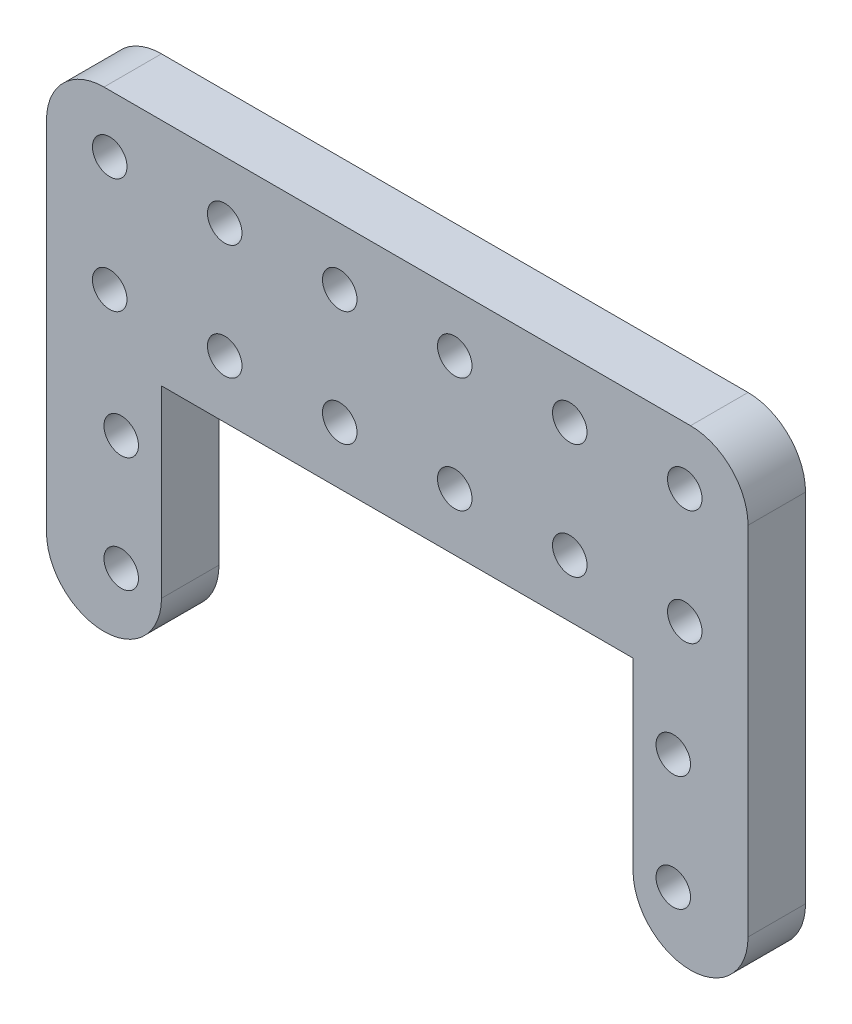
ISO-10303-21;
HEADER;
FILE_DESCRIPTION(('STEP AP214'),'2;1');
FILE_NAME('part.step','',(''),(''),'','','');
FILE_SCHEMA(('AUTOMOTIVE_DESIGN { 1 0 10303 214 1 1 1 1 }'));
ENDSEC;
DATA;
#1=APPLICATION_CONTEXT('core data for automotive mechanical design processes');
#2=APPLICATION_PROTOCOL_DEFINITION('international standard','automotive_design',2000,#1);
#3=PRODUCT_CONTEXT('',#1,'mechanical');
#4=PRODUCT('Part','Part','',(#3));
#5=PRODUCT_RELATED_PRODUCT_CATEGORY('part','',(#4));
#6=PRODUCT_DEFINITION_FORMATION('','',#4);
#7=PRODUCT_DEFINITION_CONTEXT('part definition',#1,'design');
#8=PRODUCT_DEFINITION('design','',#6,#7);
#9=PRODUCT_DEFINITION_SHAPE('','',#8);
#10=(LENGTH_UNIT() NAMED_UNIT(*) SI_UNIT(.MILLI.,.METRE.));
#11=(NAMED_UNIT(*) PLANE_ANGLE_UNIT() SI_UNIT($,.RADIAN.));
#12=(NAMED_UNIT(*) SI_UNIT($,.STERADIAN.) SOLID_ANGLE_UNIT());
#13=UNCERTAINTY_MEASURE_WITH_UNIT(LENGTH_MEASURE(1.E-05),#10,'distance_accuracy_value','');
#14=(GEOMETRIC_REPRESENTATION_CONTEXT(3) GLOBAL_UNCERTAINTY_ASSIGNED_CONTEXT((#13)) GLOBAL_UNIT_ASSIGNED_CONTEXT((#10,
#11,#12)) REPRESENTATION_CONTEXT('',''));
#15=CARTESIAN_POINT('',(0.,0.,0.));
#16=DIRECTION('',(0.,0.,1.));
#17=DIRECTION('',(1.,0.,0.));
#18=AXIS2_PLACEMENT_3D('',#15,#16,#17);
#19=CARTESIAN_POINT('',(54.2540510882395,0.,5.));
#20=DIRECTION('',(1.,0.,0.));
#21=DIRECTION('',(0.,1.,0.));
#22=AXIS2_PLACEMENT_3D('',#19,#20,#21);
#23=PLANE('',#22);
#24=DIRECTION('',(0.,-1.,0.));
#25=VECTOR('',#24,1.);
#26=CARTESIAN_POINT('',(54.2540510882395,0.,0.));
#27=LINE('',#26,#25);
#28=CARTESIAN_POINT('',(54.2540510882395,11.1987599390299,0.));
#29=VERTEX_POINT('',#28);
#30=CARTESIAN_POINT('',(54.2540510882395,-4.80124006097015,0.));
#31=VERTEX_POINT('',#30);
#32=EDGE_CURVE('E165',#29,#31,#27,.T.);
#33=ORIENTED_EDGE('',*,*,#32,.T.);
#34=DIRECTION('',(0.,0.,1.));
#35=VECTOR('',#34,1.);
#36=CARTESIAN_POINT('',(54.2540510882395,-4.80124006097015,5.));
#37=LINE('',#36,#35);
#38=CARTESIAN_POINT('',(54.2540510882395,-4.80124006097015,5.));
#39=VERTEX_POINT('',#38);
#40=EDGE_CURVE('E238',#31,#39,#37,.T.);
#41=ORIENTED_EDGE('',*,*,#40,.T.);
#42=DIRECTION('',(0.,-1.,0.));
#43=VECTOR('',#42,1.);
#44=CARTESIAN_POINT('',(54.2540510882395,0.,5.));
#45=LINE('',#44,#43);
#46=CARTESIAN_POINT('',(54.2540510882395,11.1987599390299,5.));
#47=VERTEX_POINT('',#46);
#48=EDGE_CURVE('E184',#47,#39,#45,.T.);
#49=ORIENTED_EDGE('',*,*,#48,.F.);
#50=DIRECTION('',(0.,0.,-1.));
#51=VECTOR('',#50,1.);
#52=CARTESIAN_POINT('',(54.2540510882395,11.1987599390299,5.));
#53=LINE('',#52,#51);
#54=EDGE_CURVE('E144',#47,#29,#53,.T.);
#55=ORIENTED_EDGE('',*,*,#54,.T.);
#56=EDGE_LOOP('',(#33,#41,#49,#55));
#57=FACE_BOUND('',#56,.T.);
#58=ADVANCED_FACE('F41',(#57),#23,.F.);
#59=CARTESIAN_POINT('',(64.2540510882395,0.,5.));
#60=DIRECTION('',(-1.,0.,0.));
#61=DIRECTION('',(0.,0.,1.));
#62=AXIS2_PLACEMENT_3D('',#59,#60,#61);
#63=PLANE('',#62);
#64=DIRECTION('',(0.,1.,0.));
#65=VECTOR('',#64,1.);
#66=CARTESIAN_POINT('',(64.2540510882395,0.,5.));
#67=LINE('',#66,#65);
#68=CARTESIAN_POINT('',(64.2540510882395,-4.80124006097015,5.));
#69=VERTEX_POINT('',#68);
#70=CARTESIAN_POINT('',(64.2540510882395,26.1987599390299,5.));
#71=VERTEX_POINT('',#70);
#72=EDGE_CURVE('E271',#69,#71,#67,.T.);
#73=ORIENTED_EDGE('',*,*,#72,.F.);
#74=DIRECTION('',(0.,0.,1.));
#75=VECTOR('',#74,1.);
#76=CARTESIAN_POINT('',(64.2540510882395,-4.80124006097015,5.));
#77=LINE('',#76,#75);
#78=CARTESIAN_POINT('',(64.2540510882395,-4.80124006097015,0.));
#79=VERTEX_POINT('',#78);
#80=EDGE_CURVE('E224',#69,#79,#77,.F.);
#81=ORIENTED_EDGE('',*,*,#80,.T.);
#82=DIRECTION('',(0.,1.,0.));
#83=VECTOR('',#82,1.);
#84=CARTESIAN_POINT('',(64.2540510882395,0.,0.));
#85=LINE('',#84,#83);
#86=CARTESIAN_POINT('',(64.2540510882395,26.1987599390299,0.));
#87=VERTEX_POINT('',#86);
#88=EDGE_CURVE('E169',#79,#87,#85,.T.);
#89=ORIENTED_EDGE('',*,*,#88,.T.);
#90=DIRECTION('',(0.,0.,-1.));
#91=VECTOR('',#90,1.);
#92=CARTESIAN_POINT('',(64.2540510882395,26.1987599390299,5.));
#93=LINE('',#92,#91);
#94=EDGE_CURVE('E143',#87,#71,#93,.F.);
#95=ORIENTED_EDGE('',*,*,#94,.T.);
#96=EDGE_LOOP('',(#73,#81,#89,#95));
#97=FACE_BOUND('',#96,.T.);
#98=ADVANCED_FACE('F446',(#97),#63,.F.);
#99=CARTESIAN_POINT('',(0.,31.1987599390299,5.));
#100=DIRECTION('',(0.,-1.,0.));
#101=DIRECTION('',(0.,0.,-1.));
#102=AXIS2_PLACEMENT_3D('',#99,#100,#101);
#103=PLANE('',#102);
#104=DIRECTION('',(-1.,0.,0.));
#105=VECTOR('',#104,1.);
#106=CARTESIAN_POINT('',(0.,31.1987599390299,0.));
#107=LINE('',#106,#105);
#108=CARTESIAN_POINT('',(59.2540510882395,31.1987599390299,0.));
#109=VERTEX_POINT('',#108);
#110=CARTESIAN_POINT('',(8.25405108823951,31.1987599390299,0.));
#111=VERTEX_POINT('',#110);
#112=EDGE_CURVE('E173',#109,#111,#107,.T.);
#113=ORIENTED_EDGE('',*,*,#112,.T.);
#114=DIRECTION('',(0.,0.,-1.));
#115=VECTOR('',#114,1.);
#116=CARTESIAN_POINT('',(8.25405108823951,31.1987599390299,5.));
#117=LINE('',#116,#115);
#118=CARTESIAN_POINT('',(8.25405108823951,31.1987599390299,5.));
#119=VERTEX_POINT('',#118);
#120=EDGE_CURVE('E210',#111,#119,#117,.F.);
#121=ORIENTED_EDGE('',*,*,#120,.T.);
#122=DIRECTION('',(-1.,0.,0.));
#123=VECTOR('',#122,1.);
#124=CARTESIAN_POINT('',(0.,31.1987599390299,5.));
#125=LINE('',#124,#123);
#126=CARTESIAN_POINT('',(59.2540510882395,31.1987599390299,5.));
#127=VERTEX_POINT('',#126);
#128=EDGE_CURVE('E269',#127,#119,#125,.T.);
#129=ORIENTED_EDGE('',*,*,#128,.F.);
#130=DIRECTION('',(0.,0.,-1.));
#131=VECTOR('',#130,1.);
#132=CARTESIAN_POINT('',(59.2540510882395,31.1987599390299,5.));
#133=LINE('',#132,#131);
#134=EDGE_CURVE('E206',#127,#109,#133,.T.);
#135=ORIENTED_EDGE('',*,*,#134,.T.);
#136=EDGE_LOOP('',(#113,#121,#129,#135));
#137=FACE_BOUND('',#136,.T.);
#138=ADVANCED_FACE('F452',(#137),#103,.F.);
#139=CARTESIAN_POINT('',(3.25405108823951,0.,5.));
#140=DIRECTION('',(1.,0.,0.));
#141=DIRECTION('',(0.,1.,0.));
#142=AXIS2_PLACEMENT_3D('',#139,#140,#141);
#143=PLANE('',#142);
#144=DIRECTION('',(0.,-1.,0.));
#145=VECTOR('',#144,1.);
#146=CARTESIAN_POINT('',(3.25405108823951,0.,0.));
#147=LINE('',#146,#145);
#148=CARTESIAN_POINT('',(3.25405108823951,26.1987599390299,0.));
#149=VERTEX_POINT('',#148);
#150=CARTESIAN_POINT('',(3.25405108823951,-4.80124006097015,0.));
#151=VERTEX_POINT('',#150);
#152=EDGE_CURVE('E177',#149,#151,#147,.T.);
#153=ORIENTED_EDGE('',*,*,#152,.T.);
#154=DIRECTION('',(0.,0.,1.));
#155=VECTOR('',#154,1.);
#156=CARTESIAN_POINT('',(3.25405108823951,-4.80124006097015,5.));
#157=LINE('',#156,#155);
#158=CARTESIAN_POINT('',(3.25405108823951,-4.80124006097015,5.));
#159=VERTEX_POINT('',#158);
#160=EDGE_CURVE('E11',#151,#159,#157,.T.);
#161=ORIENTED_EDGE('',*,*,#160,.T.);
#162=DIRECTION('',(0.,-1.,0.));
#163=VECTOR('',#162,1.);
#164=CARTESIAN_POINT('',(3.25405108823951,0.,5.));
#165=LINE('',#164,#163);
#166=CARTESIAN_POINT('',(3.25405108823951,26.1987599390299,5.));
#167=VERTEX_POINT('',#166);
#168=EDGE_CURVE('E155',#167,#159,#165,.T.);
#169=ORIENTED_EDGE('',*,*,#168,.F.);
#170=DIRECTION('',(0.,0.,-1.));
#171=VECTOR('',#170,1.);
#172=CARTESIAN_POINT('',(3.25405108823951,26.1987599390299,5.));
#173=LINE('',#172,#171);
#174=EDGE_CURVE('E202',#167,#149,#173,.T.);
#175=ORIENTED_EDGE('',*,*,#174,.T.);
#176=EDGE_LOOP('',(#153,#161,#169,#175));
#177=FACE_BOUND('',#176,.T.);
#178=ADVANCED_FACE('F264',(#177),#143,.F.);
#179=CARTESIAN_POINT('',(13.2540510882395,0.,5.));
#180=DIRECTION('',(1.,0.,0.));
#181=DIRECTION('',(0.,1.,0.));
#182=AXIS2_PLACEMENT_3D('',#179,#180,#181);
#183=PLANE('',#182);
#184=DIRECTION('',(0.,-1.,0.));
#185=VECTOR('',#184,1.);
#186=CARTESIAN_POINT('',(13.2540510882395,0.,5.));
#187=LINE('',#186,#185);
#188=CARTESIAN_POINT('',(13.2540510882395,11.1987599390298,5.));
#189=VERTEX_POINT('',#188);
#190=CARTESIAN_POINT('',(13.2540510882395,-4.80124006097015,5.));
#191=VERTEX_POINT('',#190);
#192=EDGE_CURVE('E135',#189,#191,#187,.T.);
#193=ORIENTED_EDGE('',*,*,#192,.T.);
#194=DIRECTION('',(0.,0.,1.));
#195=VECTOR('',#194,1.);
#196=CARTESIAN_POINT('',(13.2540510882395,-4.80124006097015,0.));
#197=LINE('',#196,#195);
#198=CARTESIAN_POINT('',(13.2540510882395,-4.80124006097015,0.));
#199=VERTEX_POINT('',#198);
#200=EDGE_CURVE('E51',#191,#199,#197,.F.);
#201=ORIENTED_EDGE('',*,*,#200,.T.);
#202=DIRECTION('',(0.,-1.,0.));
#203=VECTOR('',#202,1.);
#204=CARTESIAN_POINT('',(13.2540510882395,0.,0.));
#205=LINE('',#204,#203);
#206=CARTESIAN_POINT('',(13.2540510882395,11.1987599390298,0.));
#207=VERTEX_POINT('',#206);
#208=EDGE_CURVE('E137',#207,#199,#205,.T.);
#209=ORIENTED_EDGE('',*,*,#208,.F.);
#210=DIRECTION('',(0.,0.,-1.));
#211=VECTOR('',#210,1.);
#212=CARTESIAN_POINT('',(13.2540510882395,11.1987599390298,5.));
#213=LINE('',#212,#211);
#214=EDGE_CURVE('E131',#189,#207,#213,.T.);
#215=ORIENTED_EDGE('',*,*,#214,.F.);
#216=EDGE_LOOP('',(#193,#201,#209,#215));
#217=FACE_BOUND('',#216,.T.);
#218=ADVANCED_FACE('F133',(#217),#183,.T.);
#219=CARTESIAN_POINT('',(0.,11.1987599390298,5.));
#220=DIRECTION('',(0.,-1.,0.));
#221=DIRECTION('',(1.,0.,0.));
#222=AXIS2_PLACEMENT_3D('',#219,#220,#221);
#223=PLANE('',#222);
#224=DIRECTION('',(-1.,0.,0.));
#225=VECTOR('',#224,1.);
#226=CARTESIAN_POINT('',(0.,11.1987599390298,0.));
#227=LINE('',#226,#225);
#228=EDGE_CURVE('E182',#29,#207,#227,.T.);
#229=ORIENTED_EDGE('',*,*,#228,.F.);
#230=ORIENTED_EDGE('',*,*,#54,.F.);
#231=DIRECTION('',(-1.,0.,0.));
#232=VECTOR('',#231,1.);
#233=CARTESIAN_POINT('',(0.,11.1987599390298,5.));
#234=LINE('',#233,#232);
#235=EDGE_CURVE('E151',#47,#189,#234,.T.);
#236=ORIENTED_EDGE('',*,*,#235,.T.);
#237=ORIENTED_EDGE('',*,*,#214,.T.);
#238=EDGE_LOOP('',(#229,#230,#236,#237));
#239=FACE_BOUND('',#238,.T.);
#240=ADVANCED_FACE('F157',(#239),#223,.T.);
#241=CARTESIAN_POINT('',(0.,0.,5.));
#242=DIRECTION('',(0.,0.,1.));
#243=DIRECTION('',(1.,0.,0.));
#244=AXIS2_PLACEMENT_3D('',#241,#242,#243);
#245=PLANE('',#244);
#246=CARTESIAN_POINT('',(59.2540510882395,-4.80124006097015,5.));
#247=DIRECTION('',(0.,0.,1.));
#248=DIRECTION('',(1.,0.,0.));
#249=AXIS2_PLACEMENT_3D('',#246,#247,#248);
#250=CIRCLE('',#249,5.);
#251=CARTESIAN_POINT('',(59.2540510882395,-9.80124006097015,5.));
#252=VERTEX_POINT('',#251);
#253=EDGE_CURVE('E218',#39,#252,#250,.T.);
#254=ORIENTED_EDGE('',*,*,#253,.T.);
#255=CARTESIAN_POINT('',(59.2540510882395,-4.80124006097015,5.));
#256=DIRECTION('',(0.,0.,1.));
#257=DIRECTION('',(1.,0.,0.));
#258=AXIS2_PLACEMENT_3D('',#255,#256,#257);
#259=CIRCLE('',#258,5.);
#260=EDGE_CURVE('E221',#252,#69,#259,.T.);
#261=ORIENTED_EDGE('',*,*,#260,.T.);
#262=ORIENTED_EDGE('',*,*,#72,.T.);
#263=CARTESIAN_POINT('',(59.2540510882395,26.1987599390299,5.));
#264=DIRECTION('',(0.,0.,1.));
#265=DIRECTION('',(1.,0.,0.));
#266=AXIS2_PLACEMENT_3D('',#263,#264,#265);
#267=CIRCLE('',#266,5.);
#268=EDGE_CURVE('E196',#71,#127,#267,.T.);
#269=ORIENTED_EDGE('',*,*,#268,.T.);
#270=ORIENTED_EDGE('',*,*,#128,.T.);
#271=CARTESIAN_POINT('',(8.25405108823951,26.1987599390299,5.));
#272=DIRECTION('',(0.,0.,1.));
#273=DIRECTION('',(1.,0.,0.));
#274=AXIS2_PLACEMENT_3D('',#271,#272,#273);
#275=CIRCLE('',#274,5.);
#276=EDGE_CURVE('E199',#119,#167,#275,.T.);
#277=ORIENTED_EDGE('',*,*,#276,.T.);
#278=ORIENTED_EDGE('',*,*,#168,.T.);
#279=CARTESIAN_POINT('',(8.25405108823951,-4.80124006097015,5.));
#280=DIRECTION('',(0.,0.,1.));
#281=DIRECTION('',(1.,0.,0.));
#282=AXIS2_PLACEMENT_3D('',#279,#280,#281);
#283=CIRCLE('',#282,5.);
#284=CARTESIAN_POINT('',(8.25405108823951,-9.80124006097015,5.));
#285=VERTEX_POINT('',#284);
#286=EDGE_CURVE('E213',#159,#285,#283,.T.);
#287=ORIENTED_EDGE('',*,*,#286,.T.);
#288=CARTESIAN_POINT('',(8.25405108823951,-4.80124006097015,5.));
#289=DIRECTION('',(0.,0.,1.));
#290=DIRECTION('',(1.,0.,0.));
#291=AXIS2_PLACEMENT_3D('',#288,#289,#290);
#292=CIRCLE('',#291,5.);
#293=EDGE_CURVE('E153',#285,#191,#292,.T.);
#294=ORIENTED_EDGE('',*,*,#293,.T.);
#295=ORIENTED_EDGE('',*,*,#192,.F.);
#296=ORIENTED_EDGE('',*,*,#235,.F.);
#297=ORIENTED_EDGE('',*,*,#48,.T.);
#298=EDGE_LOOP('',(#254,#261,#262,#269,#270,#277,#278,#287,#294,#295,#296,#297));
#299=FACE_BOUND('',#298,.T.);
#300=CARTESIAN_POINT('',(58.7540510882395,26.1987599390299,5.));
#301=DIRECTION('',(0.,0.,1.));
#302=DIRECTION('',(1.,0.,0.));
#303=AXIS2_PLACEMENT_3D('',#300,#301,#302);
#304=CIRCLE('',#303,1.5);
#305=CARTESIAN_POINT('',(60.2540510882395,26.1987599390299,5.));
#306=VERTEX_POINT('',#305);
#307=EDGE_CURVE('E359',#306,#306,#304,.T.);
#308=ORIENTED_EDGE('',*,*,#307,.F.);
#309=EDGE_LOOP('',(#308));
#310=FACE_BOUND('',#309,.T.);
#311=CARTESIAN_POINT('',(18.7540510882396,16.1987599390299,5.));
#312=DIRECTION('',(0.,0.,1.));
#313=DIRECTION('',(1.,0.,0.));
#314=AXIS2_PLACEMENT_3D('',#311,#312,#313);
#315=CIRCLE('',#314,1.5);
#316=CARTESIAN_POINT('',(20.2540510882396,16.1987599390299,5.));
#317=VERTEX_POINT('',#316);
#318=EDGE_CURVE('E350',#317,#317,#315,.T.);
#319=ORIENTED_EDGE('',*,*,#318,.F.);
#320=EDGE_LOOP('',(#319));
#321=FACE_BOUND('',#320,.T.);
#322=CARTESIAN_POINT('',(28.7540510882396,16.1987599390299,5.));
#323=DIRECTION('',(0.,0.,1.));
#324=DIRECTION('',(1.,0.,0.));
#325=AXIS2_PLACEMENT_3D('',#322,#323,#324);
#326=CIRCLE('',#325,1.5);
#327=CARTESIAN_POINT('',(30.2540510882396,16.1987599390299,5.));
#328=VERTEX_POINT('',#327);
#329=EDGE_CURVE('E375',#328,#328,#326,.T.);
#330=ORIENTED_EDGE('',*,*,#329,.F.);
#331=EDGE_LOOP('',(#330));
#332=FACE_BOUND('',#331,.T.);
#333=CARTESIAN_POINT('',(38.7540510882396,16.1987599390299,5.));
#334=DIRECTION('',(0.,0.,1.));
#335=DIRECTION('',(1.,0.,0.));
#336=AXIS2_PLACEMENT_3D('',#333,#334,#335);
#337=CIRCLE('',#336,1.5);
#338=CARTESIAN_POINT('',(40.2540510882396,16.1987599390299,5.));
#339=VERTEX_POINT('',#338);
#340=EDGE_CURVE('E366',#339,#339,#337,.T.);
#341=ORIENTED_EDGE('',*,*,#340,.F.);
#342=EDGE_LOOP('',(#341));
#343=FACE_BOUND('',#342,.T.);
#344=CARTESIAN_POINT('',(48.7540510882395,26.1987599390299,5.));
#345=DIRECTION('',(0.,0.,1.));
#346=DIRECTION('',(1.,0.,0.));
#347=AXIS2_PLACEMENT_3D('',#344,#345,#346);
#348=CIRCLE('',#347,1.5);
#349=CARTESIAN_POINT('',(50.2540510882395,26.1987599390299,5.));
#350=VERTEX_POINT('',#349);
#351=EDGE_CURVE('E318',#350,#350,#348,.T.);
#352=ORIENTED_EDGE('',*,*,#351,.F.);
#353=EDGE_LOOP('',(#352));
#354=FACE_BOUND('',#353,.T.);
#355=CARTESIAN_POINT('',(38.7540510882395,26.1987599390299,5.));
#356=DIRECTION('',(0.,0.,1.));
#357=DIRECTION('',(1.,0.,0.));
#358=AXIS2_PLACEMENT_3D('',#355,#356,#357);
#359=CIRCLE('',#358,1.5);
#360=CARTESIAN_POINT('',(40.2540510882395,26.1987599390299,5.));
#361=VERTEX_POINT('',#360);
#362=EDGE_CURVE('E327',#361,#361,#359,.T.);
#363=ORIENTED_EDGE('',*,*,#362,.F.);
#364=EDGE_LOOP('',(#363));
#365=FACE_BOUND('',#364,.T.);
#366=CARTESIAN_POINT('',(28.7540510882395,26.1987599390299,5.));
#367=DIRECTION('',(0.,0.,1.));
#368=DIRECTION('',(1.,0.,0.));
#369=AXIS2_PLACEMENT_3D('',#366,#367,#368);
#370=CIRCLE('',#369,1.5);
#371=CARTESIAN_POINT('',(30.2540510882395,26.1987599390299,5.));
#372=VERTEX_POINT('',#371);
#373=EDGE_CURVE('E335',#372,#372,#370,.T.);
#374=ORIENTED_EDGE('',*,*,#373,.F.);
#375=EDGE_LOOP('',(#374));
#376=FACE_BOUND('',#375,.T.);
#377=CARTESIAN_POINT('',(18.7540510882395,26.1987599390299,5.));
#378=DIRECTION('',(0.,0.,1.));
#379=DIRECTION('',(1.,0.,0.));
#380=AXIS2_PLACEMENT_3D('',#377,#378,#379);
#381=CIRCLE('',#380,1.5);
#382=CARTESIAN_POINT('',(20.2540510882395,26.1987599390299,5.));
#383=VERTEX_POINT('',#382);
#384=EDGE_CURVE('E343',#383,#383,#381,.T.);
#385=ORIENTED_EDGE('',*,*,#384,.F.);
#386=EDGE_LOOP('',(#385));
#387=FACE_BOUND('',#386,.T.);
#388=CARTESIAN_POINT('',(48.7540510882396,16.1987599390299,5.));
#389=DIRECTION('',(0.,0.,1.));
#390=DIRECTION('',(1.,0.,0.));
#391=AXIS2_PLACEMENT_3D('',#388,#389,#390);
#392=CIRCLE('',#391,1.5);
#393=CARTESIAN_POINT('',(50.2540510882396,16.1987599390299,5.));
#394=VERTEX_POINT('',#393);
#395=EDGE_CURVE('E393',#394,#394,#392,.T.);
#396=ORIENTED_EDGE('',*,*,#395,.F.);
#397=EDGE_LOOP('',(#396));
#398=FACE_BOUND('',#397,.T.);
#399=CARTESIAN_POINT('',(58.7540510882396,16.1987599390299,5.));
#400=DIRECTION('',(0.,0.,1.));
#401=DIRECTION('',(1.,0.,0.));
#402=AXIS2_PLACEMENT_3D('',#399,#400,#401);
#403=CIRCLE('',#402,1.5);
#404=CARTESIAN_POINT('',(60.2540510882396,16.1987599390299,5.));
#405=VERTEX_POINT('',#404);
#406=EDGE_CURVE('E385',#405,#405,#403,.T.);
#407=ORIENTED_EDGE('',*,*,#406,.F.);
#408=EDGE_LOOP('',(#407));
#409=FACE_BOUND('',#408,.T.);
#410=CARTESIAN_POINT('',(8.75405108823961,16.1987599390299,5.));
#411=DIRECTION('',(0.,0.,1.));
#412=DIRECTION('',(1.,0.,0.));
#413=AXIS2_PLACEMENT_3D('',#410,#411,#412);
#414=CIRCLE('',#413,1.5);
#415=CARTESIAN_POINT('',(10.2540510882396,16.1987599390299,5.));
#416=VERTEX_POINT('',#415);
#417=EDGE_CURVE('E245',#416,#416,#414,.T.);
#418=ORIENTED_EDGE('',*,*,#417,.F.);
#419=EDGE_LOOP('',(#418));
#420=FACE_BOUND('',#419,.T.);
#421=CARTESIAN_POINT('',(8.75405108823951,26.1987599390299,5.));
#422=DIRECTION('',(0.,0.,1.));
#423=DIRECTION('',(1.,0.,0.));
#424=AXIS2_PLACEMENT_3D('',#421,#422,#423);
#425=CIRCLE('',#424,1.5);
#426=CARTESIAN_POINT('',(10.2540510882395,26.1987599390299,5.));
#427=VERTEX_POINT('',#426);
#428=EDGE_CURVE('E310',#427,#427,#425,.T.);
#429=ORIENTED_EDGE('',*,*,#428,.F.);
#430=EDGE_LOOP('',(#429));
#431=FACE_BOUND('',#430,.T.);
#432=CARTESIAN_POINT('',(57.7540510882395,-4.30124006097015,5.));
#433=DIRECTION('',(0.,0.,1.));
#434=DIRECTION('',(1.,0.,0.));
#435=AXIS2_PLACEMENT_3D('',#432,#433,#434);
#436=CIRCLE('',#435,1.5);
#437=CARTESIAN_POINT('',(59.2540510882395,-4.30124006097015,5.));
#438=VERTEX_POINT('',#437);
#439=EDGE_CURVE('E286',#438,#438,#436,.T.);
#440=ORIENTED_EDGE('',*,*,#439,.F.);
#441=EDGE_LOOP('',(#440));
#442=FACE_BOUND('',#441,.T.);
#443=CARTESIAN_POINT('',(57.7540510882395,5.69875993902985,5.));
#444=DIRECTION('',(0.,0.,1.));
#445=DIRECTION('',(1.,0.,0.));
#446=AXIS2_PLACEMENT_3D('',#443,#444,#445);
#447=CIRCLE('',#446,1.5);
#448=CARTESIAN_POINT('',(59.2540510882395,5.69875993902985,5.));
#449=VERTEX_POINT('',#448);
#450=EDGE_CURVE('E295',#449,#449,#447,.T.);
#451=ORIENTED_EDGE('',*,*,#450,.F.);
#452=EDGE_LOOP('',(#451));
#453=FACE_BOUND('',#452,.T.);
#454=CARTESIAN_POINT('',(9.7540510882395,5.69875993902985,5.));
#455=DIRECTION('',(0.,0.,1.));
#456=DIRECTION('',(1.,0.,0.));
#457=AXIS2_PLACEMENT_3D('',#454,#455,#456);
#458=CIRCLE('',#457,1.5);
#459=CARTESIAN_POINT('',(11.2540510882395,5.69875993902985,5.));
#460=VERTEX_POINT('',#459);
#461=EDGE_CURVE('E303',#460,#460,#458,.T.);
#462=ORIENTED_EDGE('',*,*,#461,.F.);
#463=EDGE_LOOP('',(#462));
#464=FACE_BOUND('',#463,.T.);
#465=CARTESIAN_POINT('',(9.75405108823951,-4.30124006097015,5.));
#466=DIRECTION('',(0.,0.,1.));
#467=DIRECTION('',(1.,0.,0.));
#468=AXIS2_PLACEMENT_3D('',#465,#466,#467);
#469=CIRCLE('',#468,1.5);
#470=CARTESIAN_POINT('',(11.2540510882395,-4.30124006097015,5.));
#471=VERTEX_POINT('',#470);
#472=EDGE_CURVE('E278',#471,#471,#469,.T.);
#473=ORIENTED_EDGE('',*,*,#472,.F.);
#474=EDGE_LOOP('',(#473));
#475=FACE_BOUND('',#474,.T.);
#476=ADVANCED_FACE('F148',(#299,#310,#321,#332,#343,#354,#365,#376,#387,#398,#409,#420,#431,
#442,#453,#464,#475),#245,.T.);
#477=CARTESIAN_POINT('',(0.,0.,0.));
#478=DIRECTION('',(0.,0.,1.));
#479=DIRECTION('',(1.,0.,0.));
#480=AXIS2_PLACEMENT_3D('',#477,#478,#479);
#481=PLANE('',#480);
#482=CARTESIAN_POINT('',(58.7540510882395,26.1987599390299,0.));
#483=DIRECTION('',(0.,0.,1.));
#484=DIRECTION('',(1.,0.,0.));
#485=AXIS2_PLACEMENT_3D('',#482,#483,#484);
#486=CIRCLE('',#485,1.5);
#487=CARTESIAN_POINT('',(60.2540510882395,26.1987599390299,0.));
#488=VERTEX_POINT('',#487);
#489=EDGE_CURVE('E323',#488,#488,#486,.T.);
#490=ORIENTED_EDGE('',*,*,#489,.T.);
#491=EDGE_LOOP('',(#490));
#492=FACE_BOUND('',#491,.T.);
#493=CARTESIAN_POINT('',(18.7540510882396,16.1987599390299,0.));
#494=DIRECTION('',(0.,0.,1.));
#495=DIRECTION('',(1.,0.,0.));
#496=AXIS2_PLACEMENT_3D('',#493,#494,#495);
#497=CIRCLE('',#496,1.5);
#498=CARTESIAN_POINT('',(20.2540510882396,16.1987599390299,0.));
#499=VERTEX_POINT('',#498);
#500=EDGE_CURVE('E354',#499,#499,#497,.T.);
#501=ORIENTED_EDGE('',*,*,#500,.T.);
#502=EDGE_LOOP('',(#501));
#503=FACE_BOUND('',#502,.T.);
#504=CARTESIAN_POINT('',(28.7540510882396,16.1987599390299,0.));
#505=DIRECTION('',(0.,0.,1.));
#506=DIRECTION('',(1.,0.,0.));
#507=AXIS2_PLACEMENT_3D('',#504,#505,#506);
#508=CIRCLE('',#507,1.5);
#509=CARTESIAN_POINT('',(30.2540510882396,16.1987599390299,0.));
#510=VERTEX_POINT('',#509);
#511=EDGE_CURVE('E355',#510,#510,#508,.T.);
#512=ORIENTED_EDGE('',*,*,#511,.T.);
#513=EDGE_LOOP('',(#512));
#514=FACE_BOUND('',#513,.T.);
#515=CARTESIAN_POINT('',(38.7540510882396,16.1987599390299,0.));
#516=DIRECTION('',(0.,0.,1.));
#517=DIRECTION('',(1.,0.,0.));
#518=AXIS2_PLACEMENT_3D('',#515,#516,#517);
#519=CIRCLE('',#518,1.5);
#520=CARTESIAN_POINT('',(40.2540510882396,16.1987599390299,0.));
#521=VERTEX_POINT('',#520);
#522=EDGE_CURVE('E370',#521,#521,#519,.T.);
#523=ORIENTED_EDGE('',*,*,#522,.T.);
#524=EDGE_LOOP('',(#523));
#525=FACE_BOUND('',#524,.T.);
#526=CARTESIAN_POINT('',(48.7540510882395,26.1987599390299,0.));
#527=DIRECTION('',(0.,0.,1.));
#528=DIRECTION('',(1.,0.,0.));
#529=AXIS2_PLACEMENT_3D('',#526,#527,#528);
#530=CIRCLE('',#529,1.5);
#531=CARTESIAN_POINT('',(50.2540510882395,26.1987599390299,0.));
#532=VERTEX_POINT('',#531);
#533=EDGE_CURVE('E322',#532,#532,#530,.T.);
#534=ORIENTED_EDGE('',*,*,#533,.T.);
#535=EDGE_LOOP('',(#534));
#536=FACE_BOUND('',#535,.T.);
#537=CARTESIAN_POINT('',(38.7540510882395,26.1987599390299,0.));
#538=DIRECTION('',(0.,0.,1.));
#539=DIRECTION('',(1.,0.,0.));
#540=AXIS2_PLACEMENT_3D('',#537,#538,#539);
#541=CIRCLE('',#540,1.5);
#542=CARTESIAN_POINT('',(40.2540510882395,26.1987599390299,0.));
#543=VERTEX_POINT('',#542);
#544=EDGE_CURVE('E331',#543,#543,#541,.T.);
#545=ORIENTED_EDGE('',*,*,#544,.T.);
#546=EDGE_LOOP('',(#545));
#547=FACE_BOUND('',#546,.T.);
#548=CARTESIAN_POINT('',(28.7540510882395,26.1987599390299,0.));
#549=DIRECTION('',(0.,0.,1.));
#550=DIRECTION('',(1.,0.,0.));
#551=AXIS2_PLACEMENT_3D('',#548,#549,#550);
#552=CIRCLE('',#551,1.5);
#553=CARTESIAN_POINT('',(30.2540510882395,26.1987599390299,0.));
#554=VERTEX_POINT('',#553);
#555=EDGE_CURVE('E339',#554,#554,#552,.T.);
#556=ORIENTED_EDGE('',*,*,#555,.T.);
#557=EDGE_LOOP('',(#556));
#558=FACE_BOUND('',#557,.T.);
#559=CARTESIAN_POINT('',(18.7540510882395,26.1987599390299,0.));
#560=DIRECTION('',(0.,0.,1.));
#561=DIRECTION('',(1.,0.,0.));
#562=AXIS2_PLACEMENT_3D('',#559,#560,#561);
#563=CIRCLE('',#562,1.5);
#564=CARTESIAN_POINT('',(20.2540510882395,26.1987599390299,0.));
#565=VERTEX_POINT('',#564);
#566=EDGE_CURVE('E314',#565,#565,#563,.T.);
#567=ORIENTED_EDGE('',*,*,#566,.T.);
#568=EDGE_LOOP('',(#567));
#569=FACE_BOUND('',#568,.T.);
#570=CARTESIAN_POINT('',(48.7540510882396,16.1987599390299,0.));
#571=DIRECTION('',(0.,0.,1.));
#572=DIRECTION('',(1.,0.,0.));
#573=AXIS2_PLACEMENT_3D('',#570,#571,#572);
#574=CIRCLE('',#573,1.5);
#575=CARTESIAN_POINT('',(50.2540510882396,16.1987599390299,0.));
#576=VERTEX_POINT('',#575);
#577=EDGE_CURVE('E371',#576,#576,#574,.T.);
#578=ORIENTED_EDGE('',*,*,#577,.T.);
#579=EDGE_LOOP('',(#578));
#580=FACE_BOUND('',#579,.T.);
#581=CARTESIAN_POINT('',(58.7540510882396,16.1987599390299,0.));
#582=DIRECTION('',(0.,0.,1.));
#583=DIRECTION('',(1.,0.,0.));
#584=AXIS2_PLACEMENT_3D('',#581,#582,#583);
#585=CIRCLE('',#584,1.5);
#586=CARTESIAN_POINT('',(60.2540510882396,16.1987599390299,0.));
#587=VERTEX_POINT('',#586);
#588=EDGE_CURVE('E389',#587,#587,#585,.T.);
#589=ORIENTED_EDGE('',*,*,#588,.T.);
#590=EDGE_LOOP('',(#589));
#591=FACE_BOUND('',#590,.T.);
#592=CARTESIAN_POINT('',(8.75405108823961,16.1987599390299,0.));
#593=DIRECTION('',(0.,0.,1.));
#594=DIRECTION('',(1.,0.,0.));
#595=AXIS2_PLACEMENT_3D('',#592,#593,#594);
#596=CIRCLE('',#595,1.5);
#597=CARTESIAN_POINT('',(10.2540510882396,16.1987599390299,0.));
#598=VERTEX_POINT('',#597);
#599=EDGE_CURVE('E252',#598,#598,#596,.T.);
#600=ORIENTED_EDGE('',*,*,#599,.T.);
#601=EDGE_LOOP('',(#600));
#602=FACE_BOUND('',#601,.T.);
#603=CARTESIAN_POINT('',(8.75405108823951,26.1987599390299,0.));
#604=DIRECTION('',(0.,0.,1.));
#605=DIRECTION('',(1.,0.,0.));
#606=AXIS2_PLACEMENT_3D('',#603,#604,#605);
#607=CIRCLE('',#606,1.5);
#608=CARTESIAN_POINT('',(10.2540510882395,26.1987599390299,0.));
#609=VERTEX_POINT('',#608);
#610=EDGE_CURVE('E291',#609,#609,#607,.T.);
#611=ORIENTED_EDGE('',*,*,#610,.T.);
#612=EDGE_LOOP('',(#611));
#613=FACE_BOUND('',#612,.T.);
#614=CARTESIAN_POINT('',(57.7540510882395,-4.30124006097015,0.));
#615=DIRECTION('',(0.,0.,1.));
#616=DIRECTION('',(1.,0.,0.));
#617=AXIS2_PLACEMENT_3D('',#614,#615,#616);
#618=CIRCLE('',#617,1.5);
#619=CARTESIAN_POINT('',(59.2540510882395,-4.30124006097015,0.));
#620=VERTEX_POINT('',#619);
#621=EDGE_CURVE('E290',#620,#620,#618,.T.);
#622=ORIENTED_EDGE('',*,*,#621,.T.);
#623=EDGE_LOOP('',(#622));
#624=FACE_BOUND('',#623,.T.);
#625=CARTESIAN_POINT('',(57.7540510882395,5.69875993902985,0.));
#626=DIRECTION('',(0.,0.,1.));
#627=DIRECTION('',(1.,0.,0.));
#628=AXIS2_PLACEMENT_3D('',#625,#626,#627);
#629=CIRCLE('',#628,1.5);
#630=CARTESIAN_POINT('',(59.2540510882395,5.69875993902985,0.));
#631=VERTEX_POINT('',#630);
#632=EDGE_CURVE('E299',#631,#631,#629,.T.);
#633=ORIENTED_EDGE('',*,*,#632,.T.);
#634=EDGE_LOOP('',(#633));
#635=FACE_BOUND('',#634,.T.);
#636=CARTESIAN_POINT('',(9.7540510882395,5.69875993902985,0.));
#637=DIRECTION('',(0.,0.,1.));
#638=DIRECTION('',(1.,0.,0.));
#639=AXIS2_PLACEMENT_3D('',#636,#637,#638);
#640=CIRCLE('',#639,1.5);
#641=CARTESIAN_POINT('',(11.2540510882395,5.69875993902985,0.));
#642=VERTEX_POINT('',#641);
#643=EDGE_CURVE('E282',#642,#642,#640,.T.);
#644=ORIENTED_EDGE('',*,*,#643,.T.);
#645=EDGE_LOOP('',(#644));
#646=FACE_BOUND('',#645,.T.);
#647=CARTESIAN_POINT('',(9.75405108823951,-4.30124006097015,0.));
#648=DIRECTION('',(0.,0.,1.));
#649=DIRECTION('',(1.,0.,0.));
#650=AXIS2_PLACEMENT_3D('',#647,#648,#649);
#651=CIRCLE('',#650,1.5);
#652=CARTESIAN_POINT('',(11.2540510882395,-4.30124006097015,0.));
#653=VERTEX_POINT('',#652);
#654=EDGE_CURVE('E170',#653,#653,#651,.T.);
#655=ORIENTED_EDGE('',*,*,#654,.T.);
#656=EDGE_LOOP('',(#655));
#657=FACE_BOUND('',#656,.T.);
#658=ORIENTED_EDGE('',*,*,#88,.F.);
#659=CARTESIAN_POINT('',(59.2540510882395,-4.80124006097015,0.));
#660=DIRECTION('',(0.,0.,1.));
#661=DIRECTION('',(1.,0.,0.));
#662=AXIS2_PLACEMENT_3D('',#659,#660,#661);
#663=CIRCLE('',#662,5.);
#664=CARTESIAN_POINT('',(59.2540510882395,-9.80124006097015,0.));
#665=VERTEX_POINT('',#664);
#666=EDGE_CURVE('E235',#79,#665,#663,.F.);
#667=ORIENTED_EDGE('',*,*,#666,.T.);
#668=CARTESIAN_POINT('',(59.2540510882395,-4.80124006097015,0.));
#669=DIRECTION('',(0.,0.,1.));
#670=DIRECTION('',(1.,0.,0.));
#671=AXIS2_PLACEMENT_3D('',#668,#669,#670);
#672=CIRCLE('',#671,5.);
#673=EDGE_CURVE('E232',#665,#31,#672,.F.);
#674=ORIENTED_EDGE('',*,*,#673,.T.);
#675=ORIENTED_EDGE('',*,*,#32,.F.);
#676=ORIENTED_EDGE('',*,*,#228,.T.);
#677=ORIENTED_EDGE('',*,*,#208,.T.);
#678=CARTESIAN_POINT('',(8.25405108823951,-4.80124006097015,0.));
#679=DIRECTION('',(0.,0.,1.));
#680=DIRECTION('',(1.,0.,0.));
#681=AXIS2_PLACEMENT_3D('',#678,#679,#680);
#682=CIRCLE('',#681,5.);
#683=CARTESIAN_POINT('',(8.25405108823951,-9.80124006097015,0.));
#684=VERTEX_POINT('',#683);
#685=EDGE_CURVE('E64',#199,#684,#682,.F.);
#686=ORIENTED_EDGE('',*,*,#685,.T.);
#687=CARTESIAN_POINT('',(8.25405108823951,-4.80124006097015,0.));
#688=DIRECTION('',(0.,0.,1.));
#689=DIRECTION('',(1.,0.,0.));
#690=AXIS2_PLACEMENT_3D('',#687,#688,#689);
#691=CIRCLE('',#690,5.);
#692=EDGE_CURVE('E59',#684,#151,#691,.F.);
#693=ORIENTED_EDGE('',*,*,#692,.T.);
#694=ORIENTED_EDGE('',*,*,#152,.F.);
#695=CARTESIAN_POINT('',(8.25405108823951,26.1987599390299,0.));
#696=DIRECTION('',(0.,0.,1.));
#697=DIRECTION('',(1.,0.,0.));
#698=AXIS2_PLACEMENT_3D('',#695,#696,#697);
#699=CIRCLE('',#698,5.);
#700=EDGE_CURVE('E193',#149,#111,#699,.F.);
#701=ORIENTED_EDGE('',*,*,#700,.T.);
#702=ORIENTED_EDGE('',*,*,#112,.F.);
#703=CARTESIAN_POINT('',(59.2540510882395,26.1987599390299,0.));
#704=DIRECTION('',(0.,0.,1.));
#705=DIRECTION('',(1.,0.,0.));
#706=AXIS2_PLACEMENT_3D('',#703,#704,#705);
#707=CIRCLE('',#706,5.);
#708=EDGE_CURVE('E189',#109,#87,#707,.F.);
#709=ORIENTED_EDGE('',*,*,#708,.T.);
#710=EDGE_LOOP('',(#658,#667,#674,#675,#676,#677,#686,#693,#694,#701,#702,#709));
#711=FACE_BOUND('',#710,.T.);
#712=ADVANCED_FACE('F401',(#492,#503,#514,#525,#536,#547,#558,#569,#580,#591,#602,#613,#624,
#635,#646,#657,#711),#481,.F.);
#713=CARTESIAN_POINT('',(9.75405108823951,-4.30124006097015,0.));
#714=DIRECTION('',(0.,0.,1.));
#715=DIRECTION('',(1.,0.,0.));
#716=AXIS2_PLACEMENT_3D('',#713,#714,#715);
#717=CYLINDRICAL_SURFACE('',#716,1.5);
#718=ORIENTED_EDGE('',*,*,#654,.F.);
#719=EDGE_LOOP('',(#718));
#720=FACE_BOUND('',#719,.T.);
#721=ORIENTED_EDGE('',*,*,#472,.T.);
#722=EDGE_LOOP('',(#721));
#723=FACE_BOUND('',#722,.T.);
#724=ADVANCED_FACE('F429',(#720,#723),#717,.F.);
#725=CARTESIAN_POINT('',(9.7540510882395,5.69875993902985,0.));
#726=DIRECTION('',(0.,0.,1.));
#727=DIRECTION('',(1.,0.,0.));
#728=AXIS2_PLACEMENT_3D('',#725,#726,#727);
#729=CYLINDRICAL_SURFACE('',#728,1.5);
#730=ORIENTED_EDGE('',*,*,#643,.F.);
#731=EDGE_LOOP('',(#730));
#732=FACE_BOUND('',#731,.T.);
#733=ORIENTED_EDGE('',*,*,#461,.T.);
#734=EDGE_LOOP('',(#733));
#735=FACE_BOUND('',#734,.T.);
#736=ADVANCED_FACE('F431',(#732,#735),#729,.F.);
#737=CARTESIAN_POINT('',(57.7540510882395,5.69875993902985,0.));
#738=DIRECTION('',(0.,0.,1.));
#739=DIRECTION('',(1.,0.,0.));
#740=AXIS2_PLACEMENT_3D('',#737,#738,#739);
#741=CYLINDRICAL_SURFACE('',#740,1.5);
#742=ORIENTED_EDGE('',*,*,#632,.F.);
#743=EDGE_LOOP('',(#742));
#744=FACE_BOUND('',#743,.T.);
#745=ORIENTED_EDGE('',*,*,#450,.T.);
#746=EDGE_LOOP('',(#745));
#747=FACE_BOUND('',#746,.T.);
#748=ADVANCED_FACE('F438',(#744,#747),#741,.F.);
#749=CARTESIAN_POINT('',(57.7540510882395,-4.30124006097015,0.));
#750=DIRECTION('',(0.,0.,1.));
#751=DIRECTION('',(1.,0.,0.));
#752=AXIS2_PLACEMENT_3D('',#749,#750,#751);
#753=CYLINDRICAL_SURFACE('',#752,1.5);
#754=ORIENTED_EDGE('',*,*,#621,.F.);
#755=EDGE_LOOP('',(#754));
#756=FACE_BOUND('',#755,.T.);
#757=ORIENTED_EDGE('',*,*,#439,.T.);
#758=EDGE_LOOP('',(#757));
#759=FACE_BOUND('',#758,.T.);
#760=ADVANCED_FACE('F584',(#756,#759),#753,.F.);
#761=CARTESIAN_POINT('',(8.75405108823951,26.1987599390299,0.));
#762=DIRECTION('',(0.,0.,1.));
#763=DIRECTION('',(1.,0.,0.));
#764=AXIS2_PLACEMENT_3D('',#761,#762,#763);
#765=CYLINDRICAL_SURFACE('',#764,1.5);
#766=ORIENTED_EDGE('',*,*,#610,.F.);
#767=EDGE_LOOP('',(#766));
#768=FACE_BOUND('',#767,.T.);
#769=ORIENTED_EDGE('',*,*,#428,.T.);
#770=EDGE_LOOP('',(#769));
#771=FACE_BOUND('',#770,.T.);
#772=ADVANCED_FACE('F576',(#768,#771),#765,.F.);
#773=CARTESIAN_POINT('',(8.75405108823961,16.1987599390299,0.));
#774=DIRECTION('',(0.,0.,1.));
#775=DIRECTION('',(1.,0.,0.));
#776=AXIS2_PLACEMENT_3D('',#773,#774,#775);
#777=CYLINDRICAL_SURFACE('',#776,1.5);
#778=ORIENTED_EDGE('',*,*,#599,.F.);
#779=EDGE_LOOP('',(#778));
#780=FACE_BOUND('',#779,.T.);
#781=ORIENTED_EDGE('',*,*,#417,.T.);
#782=EDGE_LOOP('',(#781));
#783=FACE_BOUND('',#782,.T.);
#784=ADVANCED_FACE('F568',(#780,#783),#777,.F.);
#785=CARTESIAN_POINT('',(58.7540510882396,16.1987599390299,0.));
#786=DIRECTION('',(0.,0.,1.));
#787=DIRECTION('',(1.,0.,0.));
#788=AXIS2_PLACEMENT_3D('',#785,#786,#787);
#789=CYLINDRICAL_SURFACE('',#788,1.5);
#790=ORIENTED_EDGE('',*,*,#588,.F.);
#791=EDGE_LOOP('',(#790));
#792=FACE_BOUND('',#791,.T.);
#793=ORIENTED_EDGE('',*,*,#406,.T.);
#794=EDGE_LOOP('',(#793));
#795=FACE_BOUND('',#794,.T.);
#796=ADVANCED_FACE('F408',(#792,#795),#789,.F.);
#797=CARTESIAN_POINT('',(48.7540510882396,16.1987599390299,0.));
#798=DIRECTION('',(0.,0.,1.));
#799=DIRECTION('',(1.,0.,0.));
#800=AXIS2_PLACEMENT_3D('',#797,#798,#799);
#801=CYLINDRICAL_SURFACE('',#800,1.5);
#802=ORIENTED_EDGE('',*,*,#577,.F.);
#803=EDGE_LOOP('',(#802));
#804=FACE_BOUND('',#803,.T.);
#805=ORIENTED_EDGE('',*,*,#395,.T.);
#806=EDGE_LOOP('',(#805));
#807=FACE_BOUND('',#806,.T.);
#808=ADVANCED_FACE('F404',(#804,#807),#801,.F.);
#809=CARTESIAN_POINT('',(18.7540510882395,26.1987599390299,0.));
#810=DIRECTION('',(0.,0.,1.));
#811=DIRECTION('',(1.,0.,0.));
#812=AXIS2_PLACEMENT_3D('',#809,#810,#811);
#813=CYLINDRICAL_SURFACE('',#812,1.5);
#814=ORIENTED_EDGE('',*,*,#566,.F.);
#815=EDGE_LOOP('',(#814));
#816=FACE_BOUND('',#815,.T.);
#817=ORIENTED_EDGE('',*,*,#384,.T.);
#818=EDGE_LOOP('',(#817));
#819=FACE_BOUND('',#818,.T.);
#820=ADVANCED_FACE('F407',(#816,#819),#813,.F.);
#821=CARTESIAN_POINT('',(28.7540510882395,26.1987599390299,0.));
#822=DIRECTION('',(0.,0.,1.));
#823=DIRECTION('',(1.,0.,0.));
#824=AXIS2_PLACEMENT_3D('',#821,#822,#823);
#825=CYLINDRICAL_SURFACE('',#824,1.5);
#826=ORIENTED_EDGE('',*,*,#555,.F.);
#827=EDGE_LOOP('',(#826));
#828=FACE_BOUND('',#827,.T.);
#829=ORIENTED_EDGE('',*,*,#373,.T.);
#830=EDGE_LOOP('',(#829));
#831=FACE_BOUND('',#830,.T.);
#832=ADVANCED_FACE('F542',(#828,#831),#825,.F.);
#833=CARTESIAN_POINT('',(38.7540510882395,26.1987599390299,0.));
#834=DIRECTION('',(0.,0.,1.));
#835=DIRECTION('',(1.,0.,0.));
#836=AXIS2_PLACEMENT_3D('',#833,#834,#835);
#837=CYLINDRICAL_SURFACE('',#836,1.5);
#838=ORIENTED_EDGE('',*,*,#544,.F.);
#839=EDGE_LOOP('',(#838));
#840=FACE_BOUND('',#839,.T.);
#841=ORIENTED_EDGE('',*,*,#362,.T.);
#842=EDGE_LOOP('',(#841));
#843=FACE_BOUND('',#842,.T.);
#844=ADVANCED_FACE('F534',(#840,#843),#837,.F.);
#845=CARTESIAN_POINT('',(48.7540510882395,26.1987599390299,0.));
#846=DIRECTION('',(0.,0.,1.));
#847=DIRECTION('',(1.,0.,0.));
#848=AXIS2_PLACEMENT_3D('',#845,#846,#847);
#849=CYLINDRICAL_SURFACE('',#848,1.5);
#850=ORIENTED_EDGE('',*,*,#533,.F.);
#851=EDGE_LOOP('',(#850));
#852=FACE_BOUND('',#851,.T.);
#853=ORIENTED_EDGE('',*,*,#351,.T.);
#854=EDGE_LOOP('',(#853));
#855=FACE_BOUND('',#854,.T.);
#856=ADVANCED_FACE('F526',(#852,#855),#849,.F.);
#857=CARTESIAN_POINT('',(38.7540510882396,16.1987599390299,0.));
#858=DIRECTION('',(0.,0.,1.));
#859=DIRECTION('',(1.,0.,0.));
#860=AXIS2_PLACEMENT_3D('',#857,#858,#859);
#861=CYLINDRICAL_SURFACE('',#860,1.5);
#862=ORIENTED_EDGE('',*,*,#522,.F.);
#863=EDGE_LOOP('',(#862));
#864=FACE_BOUND('',#863,.T.);
#865=ORIENTED_EDGE('',*,*,#340,.T.);
#866=EDGE_LOOP('',(#865));
#867=FACE_BOUND('',#866,.T.);
#868=ADVANCED_FACE('F518',(#864,#867),#861,.F.);
#869=CARTESIAN_POINT('',(28.7540510882396,16.1987599390299,0.));
#870=DIRECTION('',(0.,0.,1.));
#871=DIRECTION('',(1.,0.,0.));
#872=AXIS2_PLACEMENT_3D('',#869,#870,#871);
#873=CYLINDRICAL_SURFACE('',#872,1.5);
#874=ORIENTED_EDGE('',*,*,#511,.F.);
#875=EDGE_LOOP('',(#874));
#876=FACE_BOUND('',#875,.T.);
#877=ORIENTED_EDGE('',*,*,#329,.T.);
#878=EDGE_LOOP('',(#877));
#879=FACE_BOUND('',#878,.T.);
#880=ADVANCED_FACE('F510',(#876,#879),#873,.F.);
#881=CARTESIAN_POINT('',(18.7540510882396,16.1987599390299,0.));
#882=DIRECTION('',(0.,0.,1.));
#883=DIRECTION('',(1.,0.,0.));
#884=AXIS2_PLACEMENT_3D('',#881,#882,#883);
#885=CYLINDRICAL_SURFACE('',#884,1.5);
#886=ORIENTED_EDGE('',*,*,#500,.F.);
#887=EDGE_LOOP('',(#886));
#888=FACE_BOUND('',#887,.T.);
#889=ORIENTED_EDGE('',*,*,#318,.T.);
#890=EDGE_LOOP('',(#889));
#891=FACE_BOUND('',#890,.T.);
#892=ADVANCED_FACE('F502',(#888,#891),#885,.F.);
#893=CARTESIAN_POINT('',(58.7540510882395,26.1987599390299,0.));
#894=DIRECTION('',(0.,0.,1.));
#895=DIRECTION('',(1.,0.,0.));
#896=AXIS2_PLACEMENT_3D('',#893,#894,#895);
#897=CYLINDRICAL_SURFACE('',#896,1.5);
#898=ORIENTED_EDGE('',*,*,#489,.F.);
#899=EDGE_LOOP('',(#898));
#900=FACE_BOUND('',#899,.T.);
#901=ORIENTED_EDGE('',*,*,#307,.T.);
#902=EDGE_LOOP('',(#901));
#903=FACE_BOUND('',#902,.T.);
#904=ADVANCED_FACE('F461',(#900,#903),#897,.F.);
#905=CARTESIAN_POINT('',(8.25405108823951,26.1987599390299,5.));
#906=DIRECTION('',(0.,0.,-1.));
#907=DIRECTION('',(-1.,0.,0.));
#908=AXIS2_PLACEMENT_3D('',#905,#906,#907);
#909=CYLINDRICAL_SURFACE('',#908,5.);
#910=ORIENTED_EDGE('',*,*,#276,.F.);
#911=ORIENTED_EDGE('',*,*,#120,.F.);
#912=ORIENTED_EDGE('',*,*,#700,.F.);
#913=ORIENTED_EDGE('',*,*,#174,.F.);
#914=EDGE_LOOP('',(#910,#911,#912,#913));
#915=FACE_BOUND('',#914,.T.);
#916=ADVANCED_FACE('F457',(#915),#909,.T.);
#917=CARTESIAN_POINT('',(59.2540510882395,26.1987599390299,5.));
#918=DIRECTION('',(0.,0.,-1.));
#919=DIRECTION('',(-1.,0.,0.));
#920=AXIS2_PLACEMENT_3D('',#917,#918,#919);
#921=CYLINDRICAL_SURFACE('',#920,5.);
#922=ORIENTED_EDGE('',*,*,#268,.F.);
#923=ORIENTED_EDGE('',*,*,#94,.F.);
#924=ORIENTED_EDGE('',*,*,#708,.F.);
#925=ORIENTED_EDGE('',*,*,#134,.F.);
#926=EDGE_LOOP('',(#922,#923,#924,#925));
#927=FACE_BOUND('',#926,.T.);
#928=ADVANCED_FACE('F460',(#927),#921,.T.);
#929=CARTESIAN_POINT('',(59.2540510882395,-4.80124006097015,5.));
#930=DIRECTION('',(0.,0.,1.));
#931=DIRECTION('',(1.,0.,0.));
#932=AXIS2_PLACEMENT_3D('',#929,#930,#931);
#933=CYLINDRICAL_SURFACE('',#932,5.);
#934=ORIENTED_EDGE('',*,*,#40,.F.);
#935=ORIENTED_EDGE('',*,*,#673,.F.);
#936=DIRECTION('',(0.,0.,1.));
#937=VECTOR('',#936,1.);
#938=CARTESIAN_POINT('',(59.2540510882395,-9.80124006097015,-5.));
#939=LINE('',#938,#937);
#940=EDGE_CURVE('E242',#252,#665,#939,.F.);
#941=ORIENTED_EDGE('',*,*,#940,.F.);
#942=ORIENTED_EDGE('',*,*,#253,.F.);
#943=EDGE_LOOP('',(#934,#935,#941,#942));
#944=FACE_BOUND('',#943,.T.);
#945=ADVANCED_FACE('F465',(#944),#933,.T.);
#946=CARTESIAN_POINT('',(59.2540510882395,-4.80124006097015,-5.));
#947=DIRECTION('',(0.,0.,1.));
#948=DIRECTION('',(1.,0.,0.));
#949=AXIS2_PLACEMENT_3D('',#946,#947,#948);
#950=CYLINDRICAL_SURFACE('',#949,5.);
#951=ORIENTED_EDGE('',*,*,#666,.F.);
#952=ORIENTED_EDGE('',*,*,#80,.F.);
#953=ORIENTED_EDGE('',*,*,#260,.F.);
#954=ORIENTED_EDGE('',*,*,#940,.T.);
#955=EDGE_LOOP('',(#951,#952,#953,#954));
#956=FACE_BOUND('',#955,.T.);
#957=ADVANCED_FACE('F467',(#956),#950,.T.);
#958=CARTESIAN_POINT('',(8.25405108823951,-4.80124006097015,5.));
#959=DIRECTION('',(0.,0.,1.));
#960=DIRECTION('',(1.,0.,0.));
#961=AXIS2_PLACEMENT_3D('',#958,#959,#960);
#962=CYLINDRICAL_SURFACE('',#961,5.);
#963=ORIENTED_EDGE('',*,*,#160,.F.);
#964=ORIENTED_EDGE('',*,*,#692,.F.);
#965=DIRECTION('',(0.,0.,1.));
#966=VECTOR('',#965,1.);
#967=CARTESIAN_POINT('',(8.25405108823951,-9.80124006097015,-5.));
#968=LINE('',#967,#966);
#969=EDGE_CURVE('E45',#285,#684,#968,.F.);
#970=ORIENTED_EDGE('',*,*,#969,.F.);
#971=ORIENTED_EDGE('',*,*,#286,.F.);
#972=EDGE_LOOP('',(#963,#964,#970,#971));
#973=FACE_BOUND('',#972,.T.);
#974=ADVANCED_FACE('F43',(#973),#962,.T.);
#975=CARTESIAN_POINT('',(8.25405108823951,-4.80124006097015,-5.));
#976=DIRECTION('',(0.,0.,-1.));
#977=DIRECTION('',(-1.,0.,0.));
#978=AXIS2_PLACEMENT_3D('',#975,#976,#977);
#979=CYLINDRICAL_SURFACE('',#978,5.);
#980=ORIENTED_EDGE('',*,*,#685,.F.);
#981=ORIENTED_EDGE('',*,*,#200,.F.);
#982=ORIENTED_EDGE('',*,*,#293,.F.);
#983=ORIENTED_EDGE('',*,*,#969,.T.);
#984=EDGE_LOOP('',(#980,#981,#982,#983));
#985=FACE_BOUND('',#984,.T.);
#986=ADVANCED_FACE('F257',(#985),#979,.T.);
#987=CLOSED_SHELL('',(#58,#98,#138,#178,#218,#240,#476,#712,#724,#736,#748,#760,#772,#784,#796,
#808,#820,#832,#844,#856,#868,#880,#892,#904,#916,#928,#945,#957,#974,#986));
#988=MANIFOLD_SOLID_BREP('B2',#987);
#989=ADVANCED_BREP_SHAPE_REPRESENTATION('',(#18,#988),#14);
#990=SHAPE_DEFINITION_REPRESENTATION(#9,#989);
ENDSEC;
END-ISO-10303-21;
